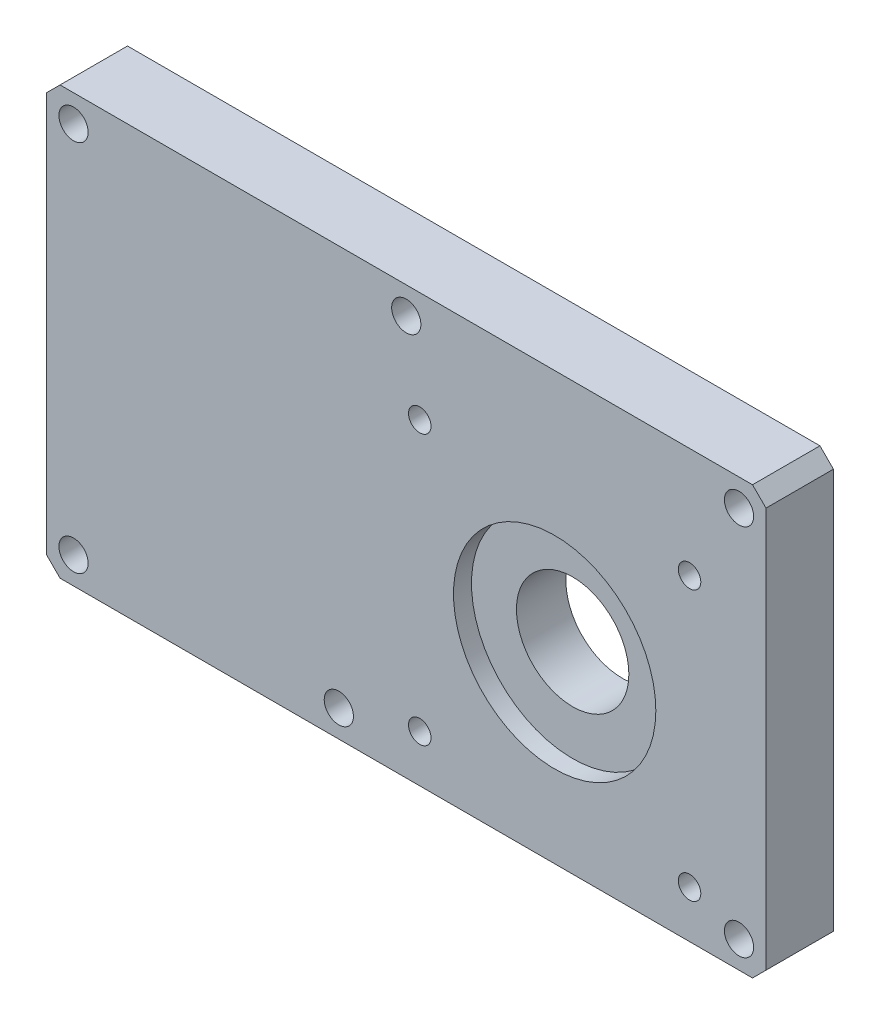
ISO-10303-21;
HEADER;
FILE_DESCRIPTION(('STEP AP214'),'2;1');
FILE_NAME('part.step','',(''),(''),'','','');
FILE_SCHEMA(('AUTOMOTIVE_DESIGN { 1 0 10303 214 1 1 1 1 }'));
ENDSEC;
DATA;
#1=APPLICATION_CONTEXT('core data for automotive mechanical design processes');
#2=APPLICATION_PROTOCOL_DEFINITION('international standard','automotive_design',2000,#1);
#3=PRODUCT_CONTEXT('',#1,'mechanical');
#4=PRODUCT('Part','Part','',(#3));
#5=PRODUCT_RELATED_PRODUCT_CATEGORY('part','',(#4));
#6=PRODUCT_DEFINITION_FORMATION('','',#4);
#7=PRODUCT_DEFINITION_CONTEXT('part definition',#1,'design');
#8=PRODUCT_DEFINITION('design','',#6,#7);
#9=PRODUCT_DEFINITION_SHAPE('','',#8);
#10=(LENGTH_UNIT() NAMED_UNIT(*) SI_UNIT(.MILLI.,.METRE.));
#11=(NAMED_UNIT(*) PLANE_ANGLE_UNIT() SI_UNIT($,.RADIAN.));
#12=(NAMED_UNIT(*) SI_UNIT($,.STERADIAN.) SOLID_ANGLE_UNIT());
#13=UNCERTAINTY_MEASURE_WITH_UNIT(LENGTH_MEASURE(1.E-05),#10,'distance_accuracy_value','');
#14=(GEOMETRIC_REPRESENTATION_CONTEXT(3) GLOBAL_UNCERTAINTY_ASSIGNED_CONTEXT((#13)) GLOBAL_UNIT_ASSIGNED_CONTEXT((#10,
#11,#12)) REPRESENTATION_CONTEXT('',''));
#15=CARTESIAN_POINT('',(0.,0.,0.));
#16=DIRECTION('',(0.,0.,1.));
#17=DIRECTION('',(1.,0.,0.));
#18=AXIS2_PLACEMENT_3D('',#15,#16,#17);
#19=CARTESIAN_POINT('',(113.,-54.25,15.));
#20=DIRECTION('',(0.,0.,-1.));
#21=DIRECTION('',(-1.,0.,0.));
#22=AXIS2_PLACEMENT_3D('',#19,#20,#21);
#23=CYLINDRICAL_SURFACE('',#22,12.5);
#24=CARTESIAN_POINT('',(113.,-54.25,0.));
#25=DIRECTION('',(0.,0.,-1.));
#26=DIRECTION('',(-1.,0.,0.));
#27=AXIS2_PLACEMENT_3D('',#24,#25,#26);
#28=CIRCLE('',#27,12.5);
#29=CARTESIAN_POINT('',(100.5,-54.25,0.));
#30=VERTEX_POINT('',#29);
#31=EDGE_CURVE('E143',#30,#30,#28,.T.);
#32=ORIENTED_EDGE('',*,*,#31,.T.);
#33=EDGE_LOOP('',(#32));
#34=FACE_BOUND('',#33,.T.);
#35=CARTESIAN_POINT('',(113.,-54.25,11.));
#36=DIRECTION('',(0.,0.,1.));
#37=DIRECTION('',(1.,0.,0.));
#38=AXIS2_PLACEMENT_3D('',#35,#36,#37);
#39=CIRCLE('',#38,12.5);
#40=CARTESIAN_POINT('',(125.5,-54.25,11.));
#41=VERTEX_POINT('',#40);
#42=EDGE_CURVE('E46',#41,#41,#39,.F.);
#43=ORIENTED_EDGE('',*,*,#42,.F.);
#44=EDGE_LOOP('',(#43));
#45=FACE_BOUND('',#44,.T.);
#46=ADVANCED_FACE('F41',(#34,#45),#23,.F.);
#47=CARTESIAN_POINT('',(0.,0.,15.));
#48=DIRECTION('',(1.,0.,0.));
#49=DIRECTION('',(0.,1.,0.));
#50=AXIS2_PLACEMENT_3D('',#47,#48,#49);
#51=PLANE('',#50);
#52=DIRECTION('',(0.,-1.,0.));
#53=VECTOR('',#52,1.);
#54=CARTESIAN_POINT('',(0.,0.,0.));
#55=LINE('',#54,#53);
#56=CARTESIAN_POINT('',(0.,-3.,0.));
#57=VERTEX_POINT('',#56);
#58=CARTESIAN_POINT('',(0.,-92.,0.));
#59=VERTEX_POINT('',#58);
#60=EDGE_CURVE('E138',#57,#59,#55,.T.);
#61=ORIENTED_EDGE('',*,*,#60,.T.);
#62=DIRECTION('',(0.,0.,1.));
#63=VECTOR('',#62,1.);
#64=CARTESIAN_POINT('',(0.,-92.,15.));
#65=LINE('',#64,#63);
#66=CARTESIAN_POINT('',(0.,-92.,15.));
#67=VERTEX_POINT('',#66);
#68=EDGE_CURVE('E115',#59,#67,#65,.T.);
#69=ORIENTED_EDGE('',*,*,#68,.T.);
#70=DIRECTION('',(0.,-1.,0.));
#71=VECTOR('',#70,1.);
#72=CARTESIAN_POINT('',(0.,0.,15.));
#73=LINE('',#72,#71);
#74=CARTESIAN_POINT('',(0.,-3.,15.));
#75=VERTEX_POINT('',#74);
#76=EDGE_CURVE('E148',#75,#67,#73,.T.);
#77=ORIENTED_EDGE('',*,*,#76,.F.);
#78=DIRECTION('',(0.,0.,-1.));
#79=VECTOR('',#78,1.);
#80=CARTESIAN_POINT('',(0.,-3.,15.));
#81=LINE('',#80,#79);
#82=EDGE_CURVE('E120',#75,#57,#81,.T.);
#83=ORIENTED_EDGE('',*,*,#82,.T.);
#84=EDGE_LOOP('',(#61,#69,#77,#83));
#85=FACE_BOUND('',#84,.T.);
#86=ADVANCED_FACE('F188',(#85),#51,.F.);
#87=CARTESIAN_POINT('',(0.,-95.,15.));
#88=DIRECTION('',(0.,1.,0.));
#89=DIRECTION('',(0.,0.,1.));
#90=AXIS2_PLACEMENT_3D('',#87,#88,#89);
#91=PLANE('',#90);
#92=DIRECTION('',(1.,0.,0.));
#93=VECTOR('',#92,1.);
#94=CARTESIAN_POINT('',(0.,-95.,15.));
#95=LINE('',#94,#93);
#96=CARTESIAN_POINT('',(3.00000000000001,-95.,15.));
#97=VERTEX_POINT('',#96);
#98=CARTESIAN_POINT('',(157.,-95.,15.));
#99=VERTEX_POINT('',#98);
#100=EDGE_CURVE('E130',#97,#99,#95,.T.);
#101=ORIENTED_EDGE('',*,*,#100,.F.);
#102=DIRECTION('',(0.,0.,-1.));
#103=VECTOR('',#102,1.);
#104=CARTESIAN_POINT('',(3.00000000000001,-95.,15.));
#105=LINE('',#104,#103);
#106=CARTESIAN_POINT('',(3.00000000000001,-95.,0.));
#107=VERTEX_POINT('',#106);
#108=EDGE_CURVE('E114',#97,#107,#105,.T.);
#109=ORIENTED_EDGE('',*,*,#108,.T.);
#110=DIRECTION('',(1.,0.,0.));
#111=VECTOR('',#110,1.);
#112=CARTESIAN_POINT('',(0.,-95.,0.));
#113=LINE('',#112,#111);
#114=CARTESIAN_POINT('',(157.,-95.,0.));
#115=VERTEX_POINT('',#114);
#116=EDGE_CURVE('E127',#107,#115,#113,.T.);
#117=ORIENTED_EDGE('',*,*,#116,.T.);
#118=DIRECTION('',(0.,0.,1.));
#119=VECTOR('',#118,1.);
#120=CARTESIAN_POINT('',(157.,-95.,15.));
#121=LINE('',#120,#119);
#122=EDGE_CURVE('E132',#115,#99,#121,.T.);
#123=ORIENTED_EDGE('',*,*,#122,.T.);
#124=EDGE_LOOP('',(#101,#109,#117,#123));
#125=FACE_BOUND('',#124,.T.);
#126=ADVANCED_FACE('F126',(#125),#91,.F.);
#127=CARTESIAN_POINT('',(160.,0.,15.));
#128=DIRECTION('',(-1.,0.,0.));
#129=DIRECTION('',(0.,0.,1.));
#130=AXIS2_PLACEMENT_3D('',#127,#128,#129);
#131=PLANE('',#130);
#132=DIRECTION('',(0.,1.,0.));
#133=VECTOR('',#132,1.);
#134=CARTESIAN_POINT('',(160.,0.,15.));
#135=LINE('',#134,#133);
#136=CARTESIAN_POINT('',(160.,-92.,15.));
#137=VERTEX_POINT('',#136);
#138=CARTESIAN_POINT('',(160.,-3.,15.));
#139=VERTEX_POINT('',#138);
#140=EDGE_CURVE('E172',#137,#139,#135,.T.);
#141=ORIENTED_EDGE('',*,*,#140,.F.);
#142=DIRECTION('',(0.,0.,-1.));
#143=VECTOR('',#142,1.);
#144=CARTESIAN_POINT('',(160.,-92.,15.));
#145=LINE('',#144,#143);
#146=CARTESIAN_POINT('',(160.,-92.,0.));
#147=VERTEX_POINT('',#146);
#148=EDGE_CURVE('E11',#137,#147,#145,.T.);
#149=ORIENTED_EDGE('',*,*,#148,.T.);
#150=DIRECTION('',(0.,1.,0.));
#151=VECTOR('',#150,1.);
#152=CARTESIAN_POINT('',(160.,0.,0.));
#153=LINE('',#152,#151);
#154=CARTESIAN_POINT('',(160.,-3.,0.));
#155=VERTEX_POINT('',#154);
#156=EDGE_CURVE('E137',#147,#155,#153,.T.);
#157=ORIENTED_EDGE('',*,*,#156,.T.);
#158=DIRECTION('',(0.,0.,1.));
#159=VECTOR('',#158,1.);
#160=CARTESIAN_POINT('',(160.,-3.,15.));
#161=LINE('',#160,#159);
#162=EDGE_CURVE('E51',#155,#139,#161,.T.);
#163=ORIENTED_EDGE('',*,*,#162,.T.);
#164=EDGE_LOOP('',(#141,#149,#157,#163));
#165=FACE_BOUND('',#164,.T.);
#166=ADVANCED_FACE('F171',(#165),#131,.F.);
#167=CARTESIAN_POINT('',(0.,0.,15.));
#168=DIRECTION('',(0.,-1.,0.));
#169=DIRECTION('',(0.,0.,-1.));
#170=AXIS2_PLACEMENT_3D('',#167,#168,#169);
#171=PLANE('',#170);
#172=DIRECTION('',(-1.,0.,0.));
#173=VECTOR('',#172,1.);
#174=CARTESIAN_POINT('',(0.,0.,0.));
#175=LINE('',#174,#173);
#176=CARTESIAN_POINT('',(157.,0.,0.));
#177=VERTEX_POINT('',#176);
#178=CARTESIAN_POINT('',(3.00000000000003,0.,0.));
#179=VERTEX_POINT('',#178);
#180=EDGE_CURVE('E141',#177,#179,#175,.T.);
#181=ORIENTED_EDGE('',*,*,#180,.T.);
#182=DIRECTION('',(0.,0.,1.));
#183=VECTOR('',#182,1.);
#184=CARTESIAN_POINT('',(3.00000000000003,0.,15.));
#185=LINE('',#184,#183);
#186=CARTESIAN_POINT('',(3.00000000000003,0.,15.));
#187=VERTEX_POINT('',#186);
#188=EDGE_CURVE('E58',#179,#187,#185,.T.);
#189=ORIENTED_EDGE('',*,*,#188,.T.);
#190=DIRECTION('',(-1.,0.,0.));
#191=VECTOR('',#190,1.);
#192=CARTESIAN_POINT('',(0.,0.,15.));
#193=LINE('',#192,#191);
#194=CARTESIAN_POINT('',(157.,0.,15.));
#195=VERTEX_POINT('',#194);
#196=EDGE_CURVE('E149',#195,#187,#193,.T.);
#197=ORIENTED_EDGE('',*,*,#196,.F.);
#198=DIRECTION('',(0.,0.,-1.));
#199=VECTOR('',#198,1.);
#200=CARTESIAN_POINT('',(157.,0.,15.));
#201=LINE('',#200,#199);
#202=EDGE_CURVE('E164',#195,#177,#201,.T.);
#203=ORIENTED_EDGE('',*,*,#202,.T.);
#204=EDGE_LOOP('',(#181,#189,#197,#203));
#205=FACE_BOUND('',#204,.T.);
#206=ADVANCED_FACE('F181',(#205),#171,.F.);
#207=CARTESIAN_POINT('',(0.,0.,15.));
#208=DIRECTION('',(0.,0.,1.));
#209=DIRECTION('',(1.,0.,0.));
#210=AXIS2_PLACEMENT_3D('',#207,#208,#209);
#211=PLANE('',#210);
#212=CARTESIAN_POINT('',(113.,-54.25,15.));
#213=DIRECTION('',(0.,0.,1.));
#214=DIRECTION('',(1.,0.,0.));
#215=AXIS2_PLACEMENT_3D('',#212,#213,#214);
#216=CIRCLE('',#215,22.5);
#217=CARTESIAN_POINT('',(135.5,-54.25,15.));
#218=VERTEX_POINT('',#217);
#219=EDGE_CURVE('E290',#218,#218,#216,.T.);
#220=ORIENTED_EDGE('',*,*,#219,.F.);
#221=EDGE_LOOP('',(#220));
#222=FACE_BOUND('',#221,.T.);
#223=CARTESIAN_POINT('',(153.999999999999,-89.,15.));
#224=DIRECTION('',(0.,0.,-1.));
#225=DIRECTION('',(-1.,0.,0.));
#226=AXIS2_PLACEMENT_3D('',#223,#224,#225);
#227=CIRCLE('',#226,3.25000000000001);
#228=CARTESIAN_POINT('',(150.749999999999,-89.,15.));
#229=VERTEX_POINT('',#228);
#230=EDGE_CURVE('E264',#229,#229,#227,.T.);
#231=ORIENTED_EDGE('',*,*,#230,.T.);
#232=EDGE_LOOP('',(#231));
#233=FACE_BOUND('',#232,.T.);
#234=CARTESIAN_POINT('',(5.99999999999914,-89.,15.));
#235=DIRECTION('',(0.,0.,-1.));
#236=DIRECTION('',(-1.,0.,0.));
#237=AXIS2_PLACEMENT_3D('',#234,#235,#236);
#238=CIRCLE('',#237,3.25000000000001);
#239=CARTESIAN_POINT('',(2.74999999999914,-89.,15.));
#240=VERTEX_POINT('',#239);
#241=EDGE_CURVE('E270',#240,#240,#238,.T.);
#242=ORIENTED_EDGE('',*,*,#241,.T.);
#243=EDGE_LOOP('',(#242));
#244=FACE_BOUND('',#243,.T.);
#245=CARTESIAN_POINT('',(6.00000000000001,-6.00000000000001,15.));
#246=DIRECTION('',(0.,0.,-1.));
#247=DIRECTION('',(-1.,0.,0.));
#248=AXIS2_PLACEMENT_3D('',#245,#246,#247);
#249=CIRCLE('',#248,3.25000000000001);
#250=CARTESIAN_POINT('',(2.75,-6.00000000000001,15.));
#251=VERTEX_POINT('',#250);
#252=EDGE_CURVE('E276',#251,#251,#249,.T.);
#253=ORIENTED_EDGE('',*,*,#252,.T.);
#254=EDGE_LOOP('',(#253));
#255=FACE_BOUND('',#254,.T.);
#256=CARTESIAN_POINT('',(80.,-6.00000000000001,15.));
#257=DIRECTION('',(0.,0.,-1.));
#258=DIRECTION('',(-1.,0.,0.));
#259=AXIS2_PLACEMENT_3D('',#256,#257,#258);
#260=CIRCLE('',#259,3.25000000000001);
#261=CARTESIAN_POINT('',(76.75,-6.00000000000001,15.));
#262=VERTEX_POINT('',#261);
#263=EDGE_CURVE('E282',#262,#262,#260,.T.);
#264=ORIENTED_EDGE('',*,*,#263,.T.);
#265=EDGE_LOOP('',(#264));
#266=FACE_BOUND('',#265,.T.);
#267=CARTESIAN_POINT('',(65.,-89.,15.));
#268=DIRECTION('',(0.,0.,-1.));
#269=DIRECTION('',(-1.,0.,0.));
#270=AXIS2_PLACEMENT_3D('',#267,#268,#269);
#271=CIRCLE('',#270,3.25);
#272=CARTESIAN_POINT('',(61.75,-89.,15.));
#273=VERTEX_POINT('',#272);
#274=EDGE_CURVE('E258',#273,#273,#271,.T.);
#275=ORIENTED_EDGE('',*,*,#274,.T.);
#276=EDGE_LOOP('',(#275));
#277=FACE_BOUND('',#276,.T.);
#278=CARTESIAN_POINT('',(154.,-6.00000000000001,15.));
#279=DIRECTION('',(0.,0.,-1.));
#280=DIRECTION('',(-1.,0.,0.));
#281=AXIS2_PLACEMENT_3D('',#278,#279,#280);
#282=CIRCLE('',#281,3.25000000000001);
#283=CARTESIAN_POINT('',(150.75,-6.00000000000001,15.));
#284=VERTEX_POINT('',#283);
#285=EDGE_CURVE('E229',#284,#284,#282,.T.);
#286=ORIENTED_EDGE('',*,*,#285,.T.);
#287=EDGE_LOOP('',(#286));
#288=FACE_BOUND('',#287,.T.);
#289=CARTESIAN_POINT('',(143.,-24.4999999999994,15.));
#290=DIRECTION('',(0.,0.,1.));
#291=DIRECTION('',(1.,0.,0.));
#292=AXIS2_PLACEMENT_3D('',#289,#290,#291);
#293=CIRCLE('',#292,2.5);
#294=CARTESIAN_POINT('',(145.5,-24.4999999999994,15.));
#295=VERTEX_POINT('',#294);
#296=EDGE_CURVE('E212',#295,#295,#293,.T.);
#297=ORIENTED_EDGE('',*,*,#296,.F.);
#298=EDGE_LOOP('',(#297));
#299=FACE_BOUND('',#298,.T.);
#300=CARTESIAN_POINT('',(83.,-24.5,15.));
#301=DIRECTION('',(0.,0.,1.));
#302=DIRECTION('',(1.,0.,0.));
#303=AXIS2_PLACEMENT_3D('',#300,#301,#302);
#304=CIRCLE('',#303,2.5);
#305=CARTESIAN_POINT('',(85.5,-24.5,15.));
#306=VERTEX_POINT('',#305);
#307=EDGE_CURVE('E206',#306,#306,#304,.T.);
#308=ORIENTED_EDGE('',*,*,#307,.F.);
#309=EDGE_LOOP('',(#308));
#310=FACE_BOUND('',#309,.T.);
#311=CARTESIAN_POINT('',(83.,-84.5,15.));
#312=DIRECTION('',(0.,0.,1.));
#313=DIRECTION('',(1.,0.,0.));
#314=AXIS2_PLACEMENT_3D('',#311,#312,#313);
#315=CIRCLE('',#314,2.5);
#316=CARTESIAN_POINT('',(85.5,-84.5,15.));
#317=VERTEX_POINT('',#316);
#318=EDGE_CURVE('E200',#317,#317,#315,.T.);
#319=ORIENTED_EDGE('',*,*,#318,.F.);
#320=EDGE_LOOP('',(#319));
#321=FACE_BOUND('',#320,.T.);
#322=CARTESIAN_POINT('',(143.,-84.4999999999994,15.));
#323=DIRECTION('',(0.,0.,1.));
#324=DIRECTION('',(1.,0.,0.));
#325=AXIS2_PLACEMENT_3D('',#322,#323,#324);
#326=CIRCLE('',#325,2.5);
#327=CARTESIAN_POINT('',(145.5,-84.4999999999994,15.));
#328=VERTEX_POINT('',#327);
#329=EDGE_CURVE('E194',#328,#328,#326,.T.);
#330=ORIENTED_EDGE('',*,*,#329,.F.);
#331=EDGE_LOOP('',(#330));
#332=FACE_BOUND('',#331,.T.);
#333=ORIENTED_EDGE('',*,*,#76,.T.);
#334=DIRECTION('',(-0.707106781186548,0.707106781186548,0.));
#335=VECTOR('',#334,1.);
#336=CARTESIAN_POINT('',(-46.,-46.,15.));
#337=LINE('',#336,#335);
#338=EDGE_CURVE('E162',#67,#97,#337,.F.);
#339=ORIENTED_EDGE('',*,*,#338,.T.);
#340=ORIENTED_EDGE('',*,*,#100,.T.);
#341=DIRECTION('',(-0.707106781186548,-0.707106781186548,0.));
#342=VECTOR('',#341,1.);
#343=CARTESIAN_POINT('',(126.,-126.,15.));
#344=LINE('',#343,#342);
#345=EDGE_CURVE('E158',#99,#137,#344,.F.);
#346=ORIENTED_EDGE('',*,*,#345,.T.);
#347=ORIENTED_EDGE('',*,*,#140,.T.);
#348=DIRECTION('',(0.707106781186548,-0.707106781186548,0.));
#349=VECTOR('',#348,1.);
#350=CARTESIAN_POINT('',(78.5,78.5,15.));
#351=LINE('',#350,#349);
#352=EDGE_CURVE('E65',#139,#195,#351,.F.);
#353=ORIENTED_EDGE('',*,*,#352,.T.);
#354=ORIENTED_EDGE('',*,*,#196,.T.);
#355=DIRECTION('',(0.707106781186551,0.707106781186544,0.));
#356=VECTOR('',#355,1.);
#357=CARTESIAN_POINT('',(1.5,-1.50000000000002,15.));
#358=LINE('',#357,#356);
#359=EDGE_CURVE('E160',#187,#75,#358,.F.);
#360=ORIENTED_EDGE('',*,*,#359,.T.);
#361=EDGE_LOOP('',(#333,#339,#340,#346,#347,#353,#354,#360));
#362=FACE_BOUND('',#361,.T.);
#363=ADVANCED_FACE('F176',(#222,#233,#244,#255,#266,#277,#288,#299,#310,#321,#332,#362),#211,.T.);
#364=CARTESIAN_POINT('',(0.,0.,0.));
#365=DIRECTION('',(0.,0.,1.));
#366=DIRECTION('',(1.,0.,0.));
#367=AXIS2_PLACEMENT_3D('',#364,#365,#366);
#368=PLANE('',#367);
#369=CARTESIAN_POINT('',(153.999999999999,-89.,0.));
#370=DIRECTION('',(0.,0.,-1.));
#371=DIRECTION('',(-1.,0.,0.));
#372=AXIS2_PLACEMENT_3D('',#369,#370,#371);
#373=CIRCLE('',#372,5.25);
#374=CARTESIAN_POINT('',(148.749999999999,-89.,0.));
#375=VERTEX_POINT('',#374);
#376=EDGE_CURVE('E225',#375,#375,#373,.T.);
#377=ORIENTED_EDGE('',*,*,#376,.F.);
#378=EDGE_LOOP('',(#377));
#379=FACE_BOUND('',#378,.T.);
#380=CARTESIAN_POINT('',(5.99999999999914,-89.,0.));
#381=DIRECTION('',(0.,0.,-1.));
#382=DIRECTION('',(-1.,0.,0.));
#383=AXIS2_PLACEMENT_3D('',#380,#381,#382);
#384=CIRCLE('',#383,5.25);
#385=CARTESIAN_POINT('',(0.74999999999914,-89.,0.));
#386=VERTEX_POINT('',#385);
#387=EDGE_CURVE('E232',#386,#386,#384,.T.);
#388=ORIENTED_EDGE('',*,*,#387,.F.);
#389=EDGE_LOOP('',(#388));
#390=FACE_BOUND('',#389,.T.);
#391=CARTESIAN_POINT('',(6.00000000000001,-6.00000000000001,0.));
#392=DIRECTION('',(0.,0.,-1.));
#393=DIRECTION('',(-1.,0.,0.));
#394=AXIS2_PLACEMENT_3D('',#391,#392,#393);
#395=CIRCLE('',#394,5.25);
#396=CARTESIAN_POINT('',(0.750000000000002,-6.00000000000001,0.));
#397=VERTEX_POINT('',#396);
#398=EDGE_CURVE('E238',#397,#397,#395,.T.);
#399=ORIENTED_EDGE('',*,*,#398,.F.);
#400=EDGE_LOOP('',(#399));
#401=FACE_BOUND('',#400,.T.);
#402=CARTESIAN_POINT('',(80.,-6.00000000000001,0.));
#403=DIRECTION('',(0.,0.,-1.));
#404=DIRECTION('',(-1.,0.,0.));
#405=AXIS2_PLACEMENT_3D('',#402,#403,#404);
#406=CIRCLE('',#405,5.25);
#407=CARTESIAN_POINT('',(74.75,-6.00000000000001,0.));
#408=VERTEX_POINT('',#407);
#409=EDGE_CURVE('E244',#408,#408,#406,.T.);
#410=ORIENTED_EDGE('',*,*,#409,.F.);
#411=EDGE_LOOP('',(#410));
#412=FACE_BOUND('',#411,.T.);
#413=CARTESIAN_POINT('',(65.,-89.,0.));
#414=DIRECTION('',(0.,0.,-1.));
#415=DIRECTION('',(-1.,0.,0.));
#416=AXIS2_PLACEMENT_3D('',#413,#414,#415);
#417=CIRCLE('',#416,5.25);
#418=CARTESIAN_POINT('',(59.75,-89.,0.));
#419=VERTEX_POINT('',#418);
#420=EDGE_CURVE('E250',#419,#419,#417,.T.);
#421=ORIENTED_EDGE('',*,*,#420,.F.);
#422=EDGE_LOOP('',(#421));
#423=FACE_BOUND('',#422,.T.);
#424=CARTESIAN_POINT('',(154.,-6.00000000000001,0.));
#425=DIRECTION('',(0.,0.,-1.));
#426=DIRECTION('',(-1.,0.,0.));
#427=AXIS2_PLACEMENT_3D('',#424,#425,#426);
#428=CIRCLE('',#427,5.25);
#429=CARTESIAN_POINT('',(148.75,-6.00000000000001,0.));
#430=VERTEX_POINT('',#429);
#431=EDGE_CURVE('E219',#430,#430,#428,.T.);
#432=ORIENTED_EDGE('',*,*,#431,.F.);
#433=EDGE_LOOP('',(#432));
#434=FACE_BOUND('',#433,.T.);
#435=CARTESIAN_POINT('',(143.,-24.4999999999994,0.));
#436=DIRECTION('',(0.,0.,-1.));
#437=DIRECTION('',(-1.,0.,0.));
#438=AXIS2_PLACEMENT_3D('',#435,#436,#437);
#439=CIRCLE('',#438,2.5);
#440=CARTESIAN_POINT('',(140.5,-24.4999999999994,0.));
#441=VERTEX_POINT('',#440);
#442=EDGE_CURVE('E215',#441,#441,#439,.T.);
#443=ORIENTED_EDGE('',*,*,#442,.F.);
#444=EDGE_LOOP('',(#443));
#445=FACE_BOUND('',#444,.T.);
#446=CARTESIAN_POINT('',(83.,-24.5,0.));
#447=DIRECTION('',(0.,0.,-1.));
#448=DIRECTION('',(-1.,0.,0.));
#449=AXIS2_PLACEMENT_3D('',#446,#447,#448);
#450=CIRCLE('',#449,2.5);
#451=CARTESIAN_POINT('',(80.5,-24.5,0.));
#452=VERTEX_POINT('',#451);
#453=EDGE_CURVE('E209',#452,#452,#450,.T.);
#454=ORIENTED_EDGE('',*,*,#453,.F.);
#455=EDGE_LOOP('',(#454));
#456=FACE_BOUND('',#455,.T.);
#457=CARTESIAN_POINT('',(83.,-84.5,0.));
#458=DIRECTION('',(0.,0.,-1.));
#459=DIRECTION('',(-1.,0.,0.));
#460=AXIS2_PLACEMENT_3D('',#457,#458,#459);
#461=CIRCLE('',#460,2.5);
#462=CARTESIAN_POINT('',(80.5,-84.5,0.));
#463=VERTEX_POINT('',#462);
#464=EDGE_CURVE('E203',#463,#463,#461,.T.);
#465=ORIENTED_EDGE('',*,*,#464,.F.);
#466=EDGE_LOOP('',(#465));
#467=FACE_BOUND('',#466,.T.);
#468=CARTESIAN_POINT('',(143.,-84.4999999999994,0.));
#469=DIRECTION('',(0.,0.,-1.));
#470=DIRECTION('',(-1.,0.,0.));
#471=AXIS2_PLACEMENT_3D('',#468,#469,#470);
#472=CIRCLE('',#471,2.5);
#473=CARTESIAN_POINT('',(140.5,-84.4999999999994,0.));
#474=VERTEX_POINT('',#473);
#475=EDGE_CURVE('E197',#474,#474,#472,.T.);
#476=ORIENTED_EDGE('',*,*,#475,.F.);
#477=EDGE_LOOP('',(#476));
#478=FACE_BOUND('',#477,.T.);
#479=ORIENTED_EDGE('',*,*,#31,.F.);
#480=EDGE_LOOP('',(#479));
#481=FACE_BOUND('',#480,.T.);
#482=ORIENTED_EDGE('',*,*,#116,.F.);
#483=DIRECTION('',(0.707106781186548,-0.707106781186548,0.));
#484=VECTOR('',#483,1.);
#485=CARTESIAN_POINT('',(3.00000000000001,-95.,0.));
#486=LINE('',#485,#484);
#487=EDGE_CURVE('E110',#107,#59,#486,.F.);
#488=ORIENTED_EDGE('',*,*,#487,.T.);
#489=ORIENTED_EDGE('',*,*,#60,.F.);
#490=DIRECTION('',(-0.707106781186551,-0.707106781186544,0.));
#491=VECTOR('',#490,1.);
#492=CARTESIAN_POINT('',(0.,-3.,0.));
#493=LINE('',#492,#491);
#494=EDGE_CURVE('E121',#57,#179,#493,.F.);
#495=ORIENTED_EDGE('',*,*,#494,.T.);
#496=ORIENTED_EDGE('',*,*,#180,.F.);
#497=DIRECTION('',(-0.707106781186548,0.707106781186548,0.));
#498=VECTOR('',#497,1.);
#499=CARTESIAN_POINT('',(157.,0.,0.));
#500=LINE('',#499,#498);
#501=EDGE_CURVE('E131',#177,#155,#500,.F.);
#502=ORIENTED_EDGE('',*,*,#501,.T.);
#503=ORIENTED_EDGE('',*,*,#156,.F.);
#504=DIRECTION('',(0.707106781186548,0.707106781186548,0.));
#505=VECTOR('',#504,1.);
#506=CARTESIAN_POINT('',(160.,-92.,0.));
#507=LINE('',#506,#505);
#508=EDGE_CURVE('E136',#147,#115,#507,.F.);
#509=ORIENTED_EDGE('',*,*,#508,.T.);
#510=EDGE_LOOP('',(#482,#488,#489,#495,#496,#502,#503,#509));
#511=FACE_BOUND('',#510,.T.);
#512=ADVANCED_FACE('F134',(#379,#390,#401,#412,#423,#434,#445,#456,#467,#478,#481,#511),#368,.F.);
#513=CARTESIAN_POINT('',(3.00000000000001,-95.,15.));
#514=DIRECTION('',(0.707106781186547,0.707106781186547,0.));
#515=DIRECTION('',(0.,0.,-1.));
#516=AXIS2_PLACEMENT_3D('',#513,#514,#515);
#517=PLANE('',#516);
#518=ORIENTED_EDGE('',*,*,#338,.F.);
#519=ORIENTED_EDGE('',*,*,#68,.F.);
#520=ORIENTED_EDGE('',*,*,#487,.F.);
#521=ORIENTED_EDGE('',*,*,#108,.F.);
#522=EDGE_LOOP('',(#518,#519,#520,#521));
#523=FACE_BOUND('',#522,.T.);
#524=ADVANCED_FACE('F113',(#523),#517,.F.);
#525=CARTESIAN_POINT('',(0.,-3.,15.));
#526=DIRECTION('',(0.707106781186544,-0.707106781186551,0.));
#527=DIRECTION('',(0.,0.,-1.));
#528=AXIS2_PLACEMENT_3D('',#525,#526,#527);
#529=PLANE('',#528);
#530=ORIENTED_EDGE('',*,*,#359,.F.);
#531=ORIENTED_EDGE('',*,*,#188,.F.);
#532=ORIENTED_EDGE('',*,*,#494,.F.);
#533=ORIENTED_EDGE('',*,*,#82,.F.);
#534=EDGE_LOOP('',(#530,#531,#532,#533));
#535=FACE_BOUND('',#534,.T.);
#536=ADVANCED_FACE('F185',(#535),#529,.F.);
#537=CARTESIAN_POINT('',(160.,-92.,15.));
#538=DIRECTION('',(-0.707106781186547,0.707106781186547,0.));
#539=DIRECTION('',(0.,0.,-1.));
#540=AXIS2_PLACEMENT_3D('',#537,#538,#539);
#541=PLANE('',#540);
#542=ORIENTED_EDGE('',*,*,#345,.F.);
#543=ORIENTED_EDGE('',*,*,#122,.F.);
#544=ORIENTED_EDGE('',*,*,#508,.F.);
#545=ORIENTED_EDGE('',*,*,#148,.F.);
#546=EDGE_LOOP('',(#542,#543,#544,#545));
#547=FACE_BOUND('',#546,.T.);
#548=ADVANCED_FACE('F335',(#547),#541,.F.);
#549=CARTESIAN_POINT('',(157.,0.,15.));
#550=DIRECTION('',(-0.707106781186547,-0.707106781186547,0.));
#551=DIRECTION('',(0.,0.,-1.));
#552=AXIS2_PLACEMENT_3D('',#549,#550,#551);
#553=PLANE('',#552);
#554=ORIENTED_EDGE('',*,*,#352,.F.);
#555=ORIENTED_EDGE('',*,*,#162,.F.);
#556=ORIENTED_EDGE('',*,*,#501,.F.);
#557=ORIENTED_EDGE('',*,*,#202,.F.);
#558=EDGE_LOOP('',(#554,#555,#556,#557));
#559=FACE_BOUND('',#558,.T.);
#560=ADVANCED_FACE('F44',(#559),#553,.F.);
#561=CARTESIAN_POINT('',(143.,-84.4999999999994,0.));
#562=DIRECTION('',(0.,0.,-1.));
#563=DIRECTION('',(-1.,0.,0.));
#564=AXIS2_PLACEMENT_3D('',#561,#562,#563);
#565=CYLINDRICAL_SURFACE('',#564,2.5);
#566=ORIENTED_EDGE('',*,*,#329,.T.);
#567=EDGE_LOOP('',(#566));
#568=FACE_BOUND('',#567,.T.);
#569=ORIENTED_EDGE('',*,*,#475,.T.);
#570=EDGE_LOOP('',(#569));
#571=FACE_BOUND('',#570,.T.);
#572=ADVANCED_FACE('F311',(#568,#571),#565,.F.);
#573=CARTESIAN_POINT('',(83.,-84.5,0.));
#574=DIRECTION('',(0.,0.,-1.));
#575=DIRECTION('',(-1.,0.,0.));
#576=AXIS2_PLACEMENT_3D('',#573,#574,#575);
#577=CYLINDRICAL_SURFACE('',#576,2.5);
#578=ORIENTED_EDGE('',*,*,#318,.T.);
#579=EDGE_LOOP('',(#578));
#580=FACE_BOUND('',#579,.T.);
#581=ORIENTED_EDGE('',*,*,#464,.T.);
#582=EDGE_LOOP('',(#581));
#583=FACE_BOUND('',#582,.T.);
#584=ADVANCED_FACE('F346',(#580,#583),#577,.F.);
#585=CARTESIAN_POINT('',(83.,-24.5,0.));
#586=DIRECTION('',(0.,0.,-1.));
#587=DIRECTION('',(-1.,0.,0.));
#588=AXIS2_PLACEMENT_3D('',#585,#586,#587);
#589=CYLINDRICAL_SURFACE('',#588,2.5);
#590=ORIENTED_EDGE('',*,*,#307,.T.);
#591=EDGE_LOOP('',(#590));
#592=FACE_BOUND('',#591,.T.);
#593=ORIENTED_EDGE('',*,*,#453,.T.);
#594=EDGE_LOOP('',(#593));
#595=FACE_BOUND('',#594,.T.);
#596=ADVANCED_FACE('F351',(#592,#595),#589,.F.);
#597=CARTESIAN_POINT('',(143.,-24.4999999999994,0.));
#598=DIRECTION('',(0.,0.,-1.));
#599=DIRECTION('',(-1.,0.,0.));
#600=AXIS2_PLACEMENT_3D('',#597,#598,#599);
#601=CYLINDRICAL_SURFACE('',#600,2.5);
#602=ORIENTED_EDGE('',*,*,#296,.T.);
#603=EDGE_LOOP('',(#602));
#604=FACE_BOUND('',#603,.T.);
#605=ORIENTED_EDGE('',*,*,#442,.T.);
#606=EDGE_LOOP('',(#605));
#607=FACE_BOUND('',#606,.T.);
#608=ADVANCED_FACE('F363',(#604,#607),#601,.F.);
#609=CARTESIAN_POINT('',(154.,-6.00000000000001,7.));
#610=DIRECTION('',(0.,0.,-1.));
#611=DIRECTION('',(-1.,0.,0.));
#612=AXIS2_PLACEMENT_3D('',#609,#610,#611);
#613=CYLINDRICAL_SURFACE('',#612,5.25);
#614=CARTESIAN_POINT('',(154.,-6.00000000000001,7.));
#615=DIRECTION('',(0.,0.,-1.));
#616=DIRECTION('',(-1.,0.,0.));
#617=AXIS2_PLACEMENT_3D('',#614,#615,#616);
#618=CIRCLE('',#617,5.25);
#619=CARTESIAN_POINT('',(148.75,-6.00000000000001,7.));
#620=VERTEX_POINT('',#619);
#621=EDGE_CURVE('E218',#620,#620,#618,.T.);
#622=ORIENTED_EDGE('',*,*,#621,.F.);
#623=EDGE_LOOP('',(#622));
#624=FACE_BOUND('',#623,.T.);
#625=ORIENTED_EDGE('',*,*,#431,.T.);
#626=EDGE_LOOP('',(#625));
#627=FACE_BOUND('',#626,.T.);
#628=ADVANCED_FACE('F370',(#624,#627),#613,.F.);
#629=CARTESIAN_POINT('',(154.,-6.00000000000001,7.));
#630=DIRECTION('',(0.,0.,-1.));
#631=DIRECTION('',(-1.,0.,0.));
#632=AXIS2_PLACEMENT_3D('',#629,#630,#631);
#633=PLANE('',#632);
#634=CARTESIAN_POINT('',(154.,-6.00000000000001,7.));
#635=DIRECTION('',(0.,0.,-1.));
#636=DIRECTION('',(-1.,0.,0.));
#637=AXIS2_PLACEMENT_3D('',#634,#635,#636);
#638=CIRCLE('',#637,3.25000000000001);
#639=CARTESIAN_POINT('',(150.75,-6.00000000000001,7.));
#640=VERTEX_POINT('',#639);
#641=EDGE_CURVE('E255',#640,#640,#638,.T.);
#642=ORIENTED_EDGE('',*,*,#641,.F.);
#643=EDGE_LOOP('',(#642));
#644=FACE_BOUND('',#643,.T.);
#645=ORIENTED_EDGE('',*,*,#621,.T.);
#646=EDGE_LOOP('',(#645));
#647=FACE_BOUND('',#646,.T.);
#648=ADVANCED_FACE('F374',(#644,#647),#633,.T.);
#649=CARTESIAN_POINT('',(65.,-89.,7.));
#650=DIRECTION('',(0.,0.,-1.));
#651=DIRECTION('',(-1.,0.,0.));
#652=AXIS2_PLACEMENT_3D('',#649,#650,#651);
#653=CYLINDRICAL_SURFACE('',#652,5.25);
#654=CARTESIAN_POINT('',(65.,-89.,7.));
#655=DIRECTION('',(0.,0.,-1.));
#656=DIRECTION('',(-1.,0.,0.));
#657=AXIS2_PLACEMENT_3D('',#654,#655,#656);
#658=CIRCLE('',#657,5.25);
#659=CARTESIAN_POINT('',(59.75,-89.,7.));
#660=VERTEX_POINT('',#659);
#661=EDGE_CURVE('E222',#660,#660,#658,.T.);
#662=ORIENTED_EDGE('',*,*,#661,.F.);
#663=EDGE_LOOP('',(#662));
#664=FACE_BOUND('',#663,.T.);
#665=ORIENTED_EDGE('',*,*,#420,.T.);
#666=EDGE_LOOP('',(#665));
#667=FACE_BOUND('',#666,.T.);
#668=ADVANCED_FACE('F378',(#664,#667),#653,.F.);
#669=CARTESIAN_POINT('',(65.,-89.,7.));
#670=DIRECTION('',(0.,0.,-1.));
#671=DIRECTION('',(-1.,0.,0.));
#672=AXIS2_PLACEMENT_3D('',#669,#670,#671);
#673=PLANE('',#672);
#674=CARTESIAN_POINT('',(65.,-89.,7.));
#675=DIRECTION('',(0.,0.,-1.));
#676=DIRECTION('',(-1.,0.,0.));
#677=AXIS2_PLACEMENT_3D('',#674,#675,#676);
#678=CIRCLE('',#677,3.25);
#679=CARTESIAN_POINT('',(61.75,-89.,7.));
#680=VERTEX_POINT('',#679);
#681=EDGE_CURVE('E285',#680,#680,#678,.T.);
#682=ORIENTED_EDGE('',*,*,#681,.F.);
#683=EDGE_LOOP('',(#682));
#684=FACE_BOUND('',#683,.T.);
#685=ORIENTED_EDGE('',*,*,#661,.T.);
#686=EDGE_LOOP('',(#685));
#687=FACE_BOUND('',#686,.T.);
#688=ADVANCED_FACE('F409',(#684,#687),#673,.T.);
#689=CARTESIAN_POINT('',(80.,-6.00000000000001,7.));
#690=DIRECTION('',(0.,0.,-1.));
#691=DIRECTION('',(-1.,0.,0.));
#692=AXIS2_PLACEMENT_3D('',#689,#690,#691);
#693=CYLINDRICAL_SURFACE('',#692,5.25);
#694=CARTESIAN_POINT('',(80.,-6.00000000000001,7.));
#695=DIRECTION('',(0.,0.,-1.));
#696=DIRECTION('',(-1.,0.,0.));
#697=AXIS2_PLACEMENT_3D('',#694,#695,#696);
#698=CIRCLE('',#697,5.25);
#699=CARTESIAN_POINT('',(74.75,-6.00000000000001,7.));
#700=VERTEX_POINT('',#699);
#701=EDGE_CURVE('E247',#700,#700,#698,.T.);
#702=ORIENTED_EDGE('',*,*,#701,.F.);
#703=EDGE_LOOP('',(#702));
#704=FACE_BOUND('',#703,.T.);
#705=ORIENTED_EDGE('',*,*,#409,.T.);
#706=EDGE_LOOP('',(#705));
#707=FACE_BOUND('',#706,.T.);
#708=ADVANCED_FACE('F406',(#704,#707),#693,.F.);
#709=CARTESIAN_POINT('',(80.,-6.00000000000001,7.));
#710=DIRECTION('',(0.,0.,-1.));
#711=DIRECTION('',(-1.,0.,0.));
#712=AXIS2_PLACEMENT_3D('',#709,#710,#711);
#713=PLANE('',#712);
#714=CARTESIAN_POINT('',(80.,-6.00000000000001,7.));
#715=DIRECTION('',(0.,0.,-1.));
#716=DIRECTION('',(-1.,0.,0.));
#717=AXIS2_PLACEMENT_3D('',#714,#715,#716);
#718=CIRCLE('',#717,3.25000000000001);
#719=CARTESIAN_POINT('',(76.75,-6.00000000000001,7.));
#720=VERTEX_POINT('',#719);
#721=EDGE_CURVE('E279',#720,#720,#718,.T.);
#722=ORIENTED_EDGE('',*,*,#721,.F.);
#723=EDGE_LOOP('',(#722));
#724=FACE_BOUND('',#723,.T.);
#725=ORIENTED_EDGE('',*,*,#701,.T.);
#726=EDGE_LOOP('',(#725));
#727=FACE_BOUND('',#726,.T.);
#728=ADVANCED_FACE('F401',(#724,#727),#713,.T.);
#729=CARTESIAN_POINT('',(6.00000000000001,-6.00000000000001,7.));
#730=DIRECTION('',(0.,0.,-1.));
#731=DIRECTION('',(-1.,0.,0.));
#732=AXIS2_PLACEMENT_3D('',#729,#730,#731);
#733=CYLINDRICAL_SURFACE('',#732,5.25);
#734=CARTESIAN_POINT('',(6.00000000000001,-6.00000000000001,7.));
#735=DIRECTION('',(0.,0.,-1.));
#736=DIRECTION('',(-1.,0.,0.));
#737=AXIS2_PLACEMENT_3D('',#734,#735,#736);
#738=CIRCLE('',#737,5.25);
#739=CARTESIAN_POINT('',(0.750000000000002,-6.00000000000001,7.));
#740=VERTEX_POINT('',#739);
#741=EDGE_CURVE('E241',#740,#740,#738,.T.);
#742=ORIENTED_EDGE('',*,*,#741,.F.);
#743=EDGE_LOOP('',(#742));
#744=FACE_BOUND('',#743,.T.);
#745=ORIENTED_EDGE('',*,*,#398,.T.);
#746=EDGE_LOOP('',(#745));
#747=FACE_BOUND('',#746,.T.);
#748=ADVANCED_FACE('F398',(#744,#747),#733,.F.);
#749=CARTESIAN_POINT('',(6.00000000000001,-6.00000000000001,7.));
#750=DIRECTION('',(0.,0.,-1.));
#751=DIRECTION('',(-1.,0.,0.));
#752=AXIS2_PLACEMENT_3D('',#749,#750,#751);
#753=PLANE('',#752);
#754=CARTESIAN_POINT('',(6.00000000000001,-6.00000000000001,7.));
#755=DIRECTION('',(0.,0.,-1.));
#756=DIRECTION('',(-1.,0.,0.));
#757=AXIS2_PLACEMENT_3D('',#754,#755,#756);
#758=CIRCLE('',#757,3.25000000000001);
#759=CARTESIAN_POINT('',(2.75,-6.00000000000001,7.));
#760=VERTEX_POINT('',#759);
#761=EDGE_CURVE('E273',#760,#760,#758,.T.);
#762=ORIENTED_EDGE('',*,*,#761,.F.);
#763=EDGE_LOOP('',(#762));
#764=FACE_BOUND('',#763,.T.);
#765=ORIENTED_EDGE('',*,*,#741,.T.);
#766=EDGE_LOOP('',(#765));
#767=FACE_BOUND('',#766,.T.);
#768=ADVANCED_FACE('F393',(#764,#767),#753,.T.);
#769=CARTESIAN_POINT('',(5.99999999999914,-89.,7.));
#770=DIRECTION('',(0.,0.,-1.));
#771=DIRECTION('',(-1.,0.,0.));
#772=AXIS2_PLACEMENT_3D('',#769,#770,#771);
#773=CYLINDRICAL_SURFACE('',#772,5.25);
#774=CARTESIAN_POINT('',(5.99999999999914,-89.,7.));
#775=DIRECTION('',(0.,0.,-1.));
#776=DIRECTION('',(-1.,0.,0.));
#777=AXIS2_PLACEMENT_3D('',#774,#775,#776);
#778=CIRCLE('',#777,5.25);
#779=CARTESIAN_POINT('',(0.74999999999914,-89.,7.));
#780=VERTEX_POINT('',#779);
#781=EDGE_CURVE('E235',#780,#780,#778,.T.);
#782=ORIENTED_EDGE('',*,*,#781,.F.);
#783=EDGE_LOOP('',(#782));
#784=FACE_BOUND('',#783,.T.);
#785=ORIENTED_EDGE('',*,*,#387,.T.);
#786=EDGE_LOOP('',(#785));
#787=FACE_BOUND('',#786,.T.);
#788=ADVANCED_FACE('F390',(#784,#787),#773,.F.);
#789=CARTESIAN_POINT('',(5.99999999999914,-89.,7.));
#790=DIRECTION('',(0.,0.,-1.));
#791=DIRECTION('',(-1.,0.,0.));
#792=AXIS2_PLACEMENT_3D('',#789,#790,#791);
#793=PLANE('',#792);
#794=CARTESIAN_POINT('',(5.99999999999914,-89.,7.));
#795=DIRECTION('',(0.,0.,-1.));
#796=DIRECTION('',(-1.,0.,0.));
#797=AXIS2_PLACEMENT_3D('',#794,#795,#796);
#798=CIRCLE('',#797,3.25000000000001);
#799=CARTESIAN_POINT('',(2.74999999999914,-89.,7.));
#800=VERTEX_POINT('',#799);
#801=EDGE_CURVE('E267',#800,#800,#798,.T.);
#802=ORIENTED_EDGE('',*,*,#801,.F.);
#803=EDGE_LOOP('',(#802));
#804=FACE_BOUND('',#803,.T.);
#805=ORIENTED_EDGE('',*,*,#781,.T.);
#806=EDGE_LOOP('',(#805));
#807=FACE_BOUND('',#806,.T.);
#808=ADVANCED_FACE('F384',(#804,#807),#793,.T.);
#809=CARTESIAN_POINT('',(153.999999999999,-89.,7.));
#810=DIRECTION('',(0.,0.,-1.));
#811=DIRECTION('',(-1.,0.,0.));
#812=AXIS2_PLACEMENT_3D('',#809,#810,#811);
#813=CYLINDRICAL_SURFACE('',#812,5.25);
#814=CARTESIAN_POINT('',(153.999999999999,-89.,7.));
#815=DIRECTION('',(0.,0.,-1.));
#816=DIRECTION('',(-1.,0.,0.));
#817=AXIS2_PLACEMENT_3D('',#814,#815,#816);
#818=CIRCLE('',#817,5.25);
#819=CARTESIAN_POINT('',(148.749999999999,-89.,7.));
#820=VERTEX_POINT('',#819);
#821=EDGE_CURVE('E228',#820,#820,#818,.T.);
#822=ORIENTED_EDGE('',*,*,#821,.F.);
#823=EDGE_LOOP('',(#822));
#824=FACE_BOUND('',#823,.T.);
#825=ORIENTED_EDGE('',*,*,#376,.T.);
#826=EDGE_LOOP('',(#825));
#827=FACE_BOUND('',#826,.T.);
#828=ADVANCED_FACE('F380',(#824,#827),#813,.F.);
#829=CARTESIAN_POINT('',(153.999999999999,-89.,7.));
#830=DIRECTION('',(0.,0.,-1.));
#831=DIRECTION('',(-1.,0.,0.));
#832=AXIS2_PLACEMENT_3D('',#829,#830,#831);
#833=PLANE('',#832);
#834=CARTESIAN_POINT('',(153.999999999999,-89.,7.));
#835=DIRECTION('',(0.,0.,-1.));
#836=DIRECTION('',(-1.,0.,0.));
#837=AXIS2_PLACEMENT_3D('',#834,#835,#836);
#838=CIRCLE('',#837,3.25000000000001);
#839=CARTESIAN_POINT('',(150.749999999999,-89.,7.));
#840=VERTEX_POINT('',#839);
#841=EDGE_CURVE('E261',#840,#840,#838,.T.);
#842=ORIENTED_EDGE('',*,*,#841,.F.);
#843=EDGE_LOOP('',(#842));
#844=FACE_BOUND('',#843,.T.);
#845=ORIENTED_EDGE('',*,*,#821,.T.);
#846=EDGE_LOOP('',(#845));
#847=FACE_BOUND('',#846,.T.);
#848=ADVANCED_FACE('F383',(#844,#847),#833,.T.);
#849=CARTESIAN_POINT('',(154.,-6.00000000000001,15.));
#850=DIRECTION('',(0.,0.,-1.));
#851=DIRECTION('',(-1.,0.,0.));
#852=AXIS2_PLACEMENT_3D('',#849,#850,#851);
#853=CYLINDRICAL_SURFACE('',#852,3.25000000000001);
#854=ORIENTED_EDGE('',*,*,#285,.F.);
#855=EDGE_LOOP('',(#854));
#856=FACE_BOUND('',#855,.T.);
#857=ORIENTED_EDGE('',*,*,#641,.T.);
#858=EDGE_LOOP('',(#857));
#859=FACE_BOUND('',#858,.T.);
#860=ADVANCED_FACE('F388',(#856,#859),#853,.F.);
#861=CARTESIAN_POINT('',(65.,-89.,15.));
#862=DIRECTION('',(0.,0.,-1.));
#863=DIRECTION('',(-1.,0.,0.));
#864=AXIS2_PLACEMENT_3D('',#861,#862,#863);
#865=CYLINDRICAL_SURFACE('',#864,3.25);
#866=ORIENTED_EDGE('',*,*,#274,.F.);
#867=EDGE_LOOP('',(#866));
#868=FACE_BOUND('',#867,.T.);
#869=ORIENTED_EDGE('',*,*,#681,.T.);
#870=EDGE_LOOP('',(#869));
#871=FACE_BOUND('',#870,.T.);
#872=ADVANCED_FACE('F422',(#868,#871),#865,.F.);
#873=CARTESIAN_POINT('',(80.,-6.00000000000001,15.));
#874=DIRECTION('',(0.,0.,-1.));
#875=DIRECTION('',(-1.,0.,0.));
#876=AXIS2_PLACEMENT_3D('',#873,#874,#875);
#877=CYLINDRICAL_SURFACE('',#876,3.25000000000001);
#878=ORIENTED_EDGE('',*,*,#263,.F.);
#879=EDGE_LOOP('',(#878));
#880=FACE_BOUND('',#879,.T.);
#881=ORIENTED_EDGE('',*,*,#721,.T.);
#882=EDGE_LOOP('',(#881));
#883=FACE_BOUND('',#882,.T.);
#884=ADVANCED_FACE('F435',(#880,#883),#877,.F.);
#885=CARTESIAN_POINT('',(6.00000000000001,-6.00000000000001,15.));
#886=DIRECTION('',(0.,0.,-1.));
#887=DIRECTION('',(-1.,0.,0.));
#888=AXIS2_PLACEMENT_3D('',#885,#886,#887);
#889=CYLINDRICAL_SURFACE('',#888,3.25000000000001);
#890=ORIENTED_EDGE('',*,*,#252,.F.);
#891=EDGE_LOOP('',(#890));
#892=FACE_BOUND('',#891,.T.);
#893=ORIENTED_EDGE('',*,*,#761,.T.);
#894=EDGE_LOOP('',(#893));
#895=FACE_BOUND('',#894,.T.);
#896=ADVANCED_FACE('F431',(#892,#895),#889,.F.);
#897=CARTESIAN_POINT('',(5.99999999999914,-89.,15.));
#898=DIRECTION('',(0.,0.,-1.));
#899=DIRECTION('',(-1.,0.,0.));
#900=AXIS2_PLACEMENT_3D('',#897,#898,#899);
#901=CYLINDRICAL_SURFACE('',#900,3.25000000000001);
#902=ORIENTED_EDGE('',*,*,#241,.F.);
#903=EDGE_LOOP('',(#902));
#904=FACE_BOUND('',#903,.T.);
#905=ORIENTED_EDGE('',*,*,#801,.T.);
#906=EDGE_LOOP('',(#905));
#907=FACE_BOUND('',#906,.T.);
#908=ADVANCED_FACE('F427',(#904,#907),#901,.F.);
#909=CARTESIAN_POINT('',(153.999999999999,-89.,15.));
#910=DIRECTION('',(0.,0.,-1.));
#911=DIRECTION('',(-1.,0.,0.));
#912=AXIS2_PLACEMENT_3D('',#909,#910,#911);
#913=CYLINDRICAL_SURFACE('',#912,3.25000000000001);
#914=ORIENTED_EDGE('',*,*,#230,.F.);
#915=EDGE_LOOP('',(#914));
#916=FACE_BOUND('',#915,.T.);
#917=ORIENTED_EDGE('',*,*,#841,.T.);
#918=EDGE_LOOP('',(#917));
#919=FACE_BOUND('',#918,.T.);
#920=ADVANCED_FACE('F424',(#916,#919),#913,.F.);
#921=CARTESIAN_POINT('',(113.,-54.25,11.));
#922=DIRECTION('',(0.,0.,1.));
#923=DIRECTION('',(1.,0.,0.));
#924=AXIS2_PLACEMENT_3D('',#921,#922,#923);
#925=PLANE('',#924);
#926=CARTESIAN_POINT('',(113.,-54.25,11.));
#927=DIRECTION('',(0.,0.,1.));
#928=DIRECTION('',(1.,0.,0.));
#929=AXIS2_PLACEMENT_3D('',#926,#927,#928);
#930=CIRCLE('',#929,22.5);
#931=CARTESIAN_POINT('',(135.5,-54.25,11.));
#932=VERTEX_POINT('',#931);
#933=EDGE_CURVE('E293',#932,#932,#930,.T.);
#934=ORIENTED_EDGE('',*,*,#933,.T.);
#935=EDGE_LOOP('',(#934));
#936=FACE_BOUND('',#935,.T.);
#937=ORIENTED_EDGE('',*,*,#42,.T.);
#938=EDGE_LOOP('',(#937));
#939=FACE_BOUND('',#938,.T.);
#940=ADVANCED_FACE('F300',(#936,#939),#925,.T.);
#941=CARTESIAN_POINT('',(113.,-54.25,11.));
#942=DIRECTION('',(0.,0.,1.));
#943=DIRECTION('',(1.,0.,0.));
#944=AXIS2_PLACEMENT_3D('',#941,#942,#943);
#945=CYLINDRICAL_SURFACE('',#944,22.5);
#946=ORIENTED_EDGE('',*,*,#933,.F.);
#947=EDGE_LOOP('',(#946));
#948=FACE_BOUND('',#947,.T.);
#949=ORIENTED_EDGE('',*,*,#219,.T.);
#950=EDGE_LOOP('',(#949));
#951=FACE_BOUND('',#950,.T.);
#952=ADVANCED_FACE('F443',(#948,#951),#945,.F.);
#953=CLOSED_SHELL('',(#46,#86,#126,#166,#206,#363,#512,#524,#536,#548,#560,#572,#584,#596,#608,
#628,#648,#668,#688,#708,#728,#748,#768,#788,#808,#828,#848,#860,#872,#884,#896,#908,#920,#940,#952));
#954=MANIFOLD_SOLID_BREP('B2',#953);
#955=ADVANCED_BREP_SHAPE_REPRESENTATION('',(#18,#954),#14);
#956=SHAPE_DEFINITION_REPRESENTATION(#9,#955);
ENDSEC;
END-ISO-10303-21;
